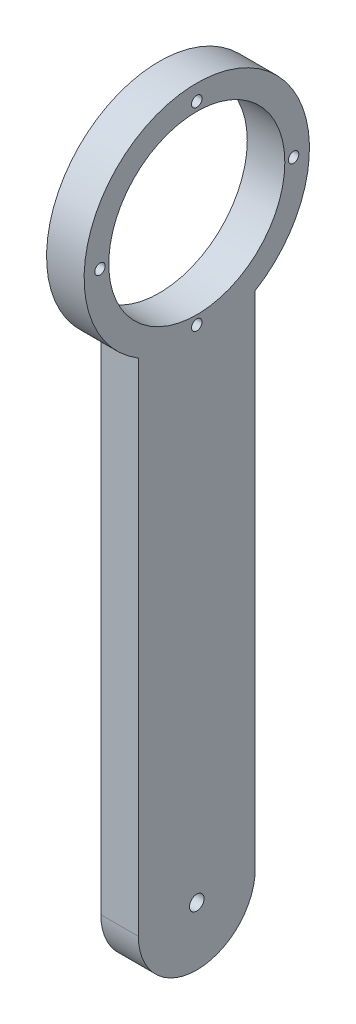
ISO-10303-21;
HEADER;
FILE_DESCRIPTION(('STEP AP214'),'2;1');
FILE_NAME('part.step','',(''),(''),'','','');
FILE_SCHEMA(('AUTOMOTIVE_DESIGN { 1 0 10303 214 1 1 1 1 }'));
ENDSEC;
DATA;
#1=APPLICATION_CONTEXT('core data for automotive mechanical design processes');
#2=APPLICATION_PROTOCOL_DEFINITION('international standard','automotive_design',2000,#1);
#3=PRODUCT_CONTEXT('',#1,'mechanical');
#4=PRODUCT('Part','Part','',(#3));
#5=PRODUCT_RELATED_PRODUCT_CATEGORY('part','',(#4));
#6=PRODUCT_DEFINITION_FORMATION('','',#4);
#7=PRODUCT_DEFINITION_CONTEXT('part definition',#1,'design');
#8=PRODUCT_DEFINITION('design','',#6,#7);
#9=PRODUCT_DEFINITION_SHAPE('','',#8);
#10=(LENGTH_UNIT() NAMED_UNIT(*) SI_UNIT(.MILLI.,.METRE.));
#11=(NAMED_UNIT(*) PLANE_ANGLE_UNIT() SI_UNIT($,.RADIAN.));
#12=(NAMED_UNIT(*) SI_UNIT($,.STERADIAN.) SOLID_ANGLE_UNIT());
#13=UNCERTAINTY_MEASURE_WITH_UNIT(LENGTH_MEASURE(1.E-05),#10,'distance_accuracy_value','');
#14=(GEOMETRIC_REPRESENTATION_CONTEXT(3) GLOBAL_UNCERTAINTY_ASSIGNED_CONTEXT((#13)) GLOBAL_UNIT_ASSIGNED_CONTEXT((#10,
#11,#12)) REPRESENTATION_CONTEXT('',''));
#15=CARTESIAN_POINT('',(0.,0.,0.));
#16=DIRECTION('',(0.,0.,1.));
#17=DIRECTION('',(1.,0.,0.));
#18=AXIS2_PLACEMENT_3D('',#15,#16,#17);
#19=CARTESIAN_POINT('',(9.,0.,-14.));
#20=DIRECTION('',(-1.,0.,0.));
#21=DIRECTION('',(0.,0.,1.));
#22=AXIS2_PLACEMENT_3D('',#19,#20,#21);
#23=CYLINDRICAL_SURFACE('',#22,14.);
#24=CARTESIAN_POINT('',(0.,0.,-14.));
#25=DIRECTION('',(1.,0.,0.));
#26=DIRECTION('',(0.,0.,-1.));
#27=AXIS2_PLACEMENT_3D('',#24,#25,#26);
#28=CIRCLE('',#27,14.);
#29=CARTESIAN_POINT('',(0.,0.,0.));
#30=VERTEX_POINT('',#29);
#31=CARTESIAN_POINT('',(0.,0.,-28.));
#32=VERTEX_POINT('',#31);
#33=EDGE_CURVE('E110',#30,#32,#28,.T.);
#34=ORIENTED_EDGE('',*,*,#33,.T.);
#35=DIRECTION('',(-1.,0.,0.));
#36=VECTOR('',#35,1.);
#37=CARTESIAN_POINT('',(9.,0.,-28.));
#38=LINE('',#37,#36);
#39=CARTESIAN_POINT('',(9.,0.,-28.));
#40=VERTEX_POINT('',#39);
#41=EDGE_CURVE('E11',#40,#32,#38,.T.);
#42=ORIENTED_EDGE('',*,*,#41,.F.);
#43=CARTESIAN_POINT('',(9.,0.,-14.));
#44=DIRECTION('',(1.,0.,0.));
#45=DIRECTION('',(0.,0.,-1.));
#46=AXIS2_PLACEMENT_3D('',#43,#44,#45);
#47=CIRCLE('',#46,14.);
#48=CARTESIAN_POINT('',(9.,0.,0.));
#49=VERTEX_POINT('',#48);
#50=EDGE_CURVE('E93',#49,#40,#47,.T.);
#51=ORIENTED_EDGE('',*,*,#50,.F.);
#52=DIRECTION('',(-1.,0.,0.));
#53=VECTOR('',#52,1.);
#54=CARTESIAN_POINT('',(9.,0.,0.));
#55=LINE('',#54,#53);
#56=EDGE_CURVE('E106',#49,#30,#55,.T.);
#57=ORIENTED_EDGE('',*,*,#56,.T.);
#58=EDGE_LOOP('',(#34,#42,#51,#57));
#59=FACE_BOUND('',#58,.T.);
#60=ADVANCED_FACE('F39',(#59),#23,.T.);
#61=CARTESIAN_POINT('',(9.,0.,-28.));
#62=DIRECTION('',(0.,0.,1.));
#63=DIRECTION('',(1.,0.,0.));
#64=AXIS2_PLACEMENT_3D('',#61,#62,#63);
#65=PLANE('',#64);
#66=DIRECTION('',(0.,1.,0.));
#67=VECTOR('',#66,1.);
#68=CARTESIAN_POINT('',(0.,0.,-28.));
#69=LINE('',#68,#67);
#70=CARTESIAN_POINT('',(0.,120.,-28.));
#71=VERTEX_POINT('',#70);
#72=EDGE_CURVE('E98',#32,#71,#69,.T.);
#73=ORIENTED_EDGE('',*,*,#72,.T.);
#74=DIRECTION('',(-1.,0.,0.));
#75=VECTOR('',#74,1.);
#76=CARTESIAN_POINT('',(9.,120.,-28.));
#77=LINE('',#76,#75);
#78=CARTESIAN_POINT('',(9.,120.,-28.));
#79=VERTEX_POINT('',#78);
#80=EDGE_CURVE('E49',#79,#71,#77,.T.);
#81=ORIENTED_EDGE('',*,*,#80,.F.);
#82=DIRECTION('',(0.,1.,0.));
#83=VECTOR('',#82,1.);
#84=CARTESIAN_POINT('',(9.,0.,-28.));
#85=LINE('',#84,#83);
#86=EDGE_CURVE('E88',#40,#79,#85,.T.);
#87=ORIENTED_EDGE('',*,*,#86,.F.);
#88=ORIENTED_EDGE('',*,*,#41,.T.);
#89=EDGE_LOOP('',(#73,#81,#87,#88));
#90=FACE_BOUND('',#89,.T.);
#91=ADVANCED_FACE('F97',(#90),#65,.F.);
#92=CARTESIAN_POINT('',(9.,143.08679276123,-14.));
#93=DIRECTION('',(-1.,0.,0.));
#94=DIRECTION('',(0.,0.,1.));
#95=AXIS2_PLACEMENT_3D('',#92,#93,#94);
#96=CYLINDRICAL_SURFACE('',#95,27.);
#97=CARTESIAN_POINT('',(0.,143.08679276123,-14.));
#98=DIRECTION('',(1.,0.,0.));
#99=DIRECTION('',(0.,0.,-1.));
#100=AXIS2_PLACEMENT_3D('',#97,#98,#99);
#101=CIRCLE('',#100,27.);
#102=CARTESIAN_POINT('',(0.,120.,0.));
#103=VERTEX_POINT('',#102);
#104=EDGE_CURVE('E75',#71,#103,#101,.T.);
#105=ORIENTED_EDGE('',*,*,#104,.T.);
#106=DIRECTION('',(-1.,0.,0.));
#107=VECTOR('',#106,1.);
#108=CARTESIAN_POINT('',(9.,120.,0.));
#109=LINE('',#108,#107);
#110=CARTESIAN_POINT('',(9.,120.,0.));
#111=VERTEX_POINT('',#110);
#112=EDGE_CURVE('E100',#111,#103,#109,.T.);
#113=ORIENTED_EDGE('',*,*,#112,.F.);
#114=CARTESIAN_POINT('',(9.,143.08679276123,-14.));
#115=DIRECTION('',(1.,0.,0.));
#116=DIRECTION('',(0.,0.,-1.));
#117=AXIS2_PLACEMENT_3D('',#114,#115,#116);
#118=CIRCLE('',#117,27.);
#119=EDGE_CURVE('E91',#79,#111,#118,.T.);
#120=ORIENTED_EDGE('',*,*,#119,.F.);
#121=ORIENTED_EDGE('',*,*,#80,.T.);
#122=EDGE_LOOP('',(#105,#113,#120,#121));
#123=FACE_BOUND('',#122,.T.);
#124=ADVANCED_FACE('F102',(#123),#96,.T.);
#125=CARTESIAN_POINT('',(9.,0.,0.));
#126=DIRECTION('',(0.,0.,-1.));
#127=DIRECTION('',(-1.,0.,0.));
#128=AXIS2_PLACEMENT_3D('',#125,#126,#127);
#129=PLANE('',#128);
#130=DIRECTION('',(0.,-1.,0.));
#131=VECTOR('',#130,1.);
#132=CARTESIAN_POINT('',(0.,0.,0.));
#133=LINE('',#132,#131);
#134=EDGE_CURVE('E81',#103,#30,#133,.T.);
#135=ORIENTED_EDGE('',*,*,#134,.T.);
#136=ORIENTED_EDGE('',*,*,#56,.F.);
#137=DIRECTION('',(0.,-1.,0.));
#138=VECTOR('',#137,1.);
#139=CARTESIAN_POINT('',(9.,0.,0.));
#140=LINE('',#139,#138);
#141=EDGE_CURVE('E58',#111,#49,#140,.T.);
#142=ORIENTED_EDGE('',*,*,#141,.F.);
#143=ORIENTED_EDGE('',*,*,#112,.T.);
#144=EDGE_LOOP('',(#135,#136,#142,#143));
#145=FACE_BOUND('',#144,.T.);
#146=ADVANCED_FACE('F192',(#145),#129,.F.);
#147=CARTESIAN_POINT('',(9.,0.,-14.));
#148=DIRECTION('',(1.,0.,0.));
#149=DIRECTION('',(0.,0.,-1.));
#150=AXIS2_PLACEMENT_3D('',#147,#148,#149);
#151=PLANE('',#150);
#152=CARTESIAN_POINT('',(9.,143.08679276123,9.2));
#153=DIRECTION('',(1.,0.,0.));
#154=DIRECTION('',(0.,0.,-1.));
#155=AXIS2_PLACEMENT_3D('',#152,#153,#154);
#156=CIRCLE('',#155,1.25);
#157=CARTESIAN_POINT('',(9.,143.08679276123,7.95));
#158=VERTEX_POINT('',#157);
#159=EDGE_CURVE('E142',#158,#158,#156,.T.);
#160=ORIENTED_EDGE('',*,*,#159,.F.);
#161=EDGE_LOOP('',(#160));
#162=FACE_BOUND('',#161,.T.);
#163=CARTESIAN_POINT('',(9.,119.88679276123,-14.));
#164=DIRECTION('',(1.,0.,0.));
#165=DIRECTION('',(0.,0.,-1.));
#166=AXIS2_PLACEMENT_3D('',#163,#164,#165);
#167=CIRCLE('',#166,1.25);
#168=CARTESIAN_POINT('',(9.,119.88679276123,-15.25));
#169=VERTEX_POINT('',#168);
#170=EDGE_CURVE('E146',#169,#169,#167,.T.);
#171=ORIENTED_EDGE('',*,*,#170,.F.);
#172=EDGE_LOOP('',(#171));
#173=FACE_BOUND('',#172,.T.);
#174=CARTESIAN_POINT('',(9.,143.08679276123,-37.2));
#175=DIRECTION('',(1.,0.,0.));
#176=DIRECTION('',(0.,0.,-1.));
#177=AXIS2_PLACEMENT_3D('',#174,#175,#176);
#178=CIRCLE('',#177,1.25);
#179=CARTESIAN_POINT('',(9.,143.08679276123,-38.45));
#180=VERTEX_POINT('',#179);
#181=EDGE_CURVE('E150',#180,#180,#178,.T.);
#182=ORIENTED_EDGE('',*,*,#181,.F.);
#183=EDGE_LOOP('',(#182));
#184=FACE_BOUND('',#183,.T.);
#185=CARTESIAN_POINT('',(9.,166.28679276123,-14.));
#186=DIRECTION('',(1.,0.,0.));
#187=DIRECTION('',(0.,0.,-1.));
#188=AXIS2_PLACEMENT_3D('',#185,#186,#187);
#189=CIRCLE('',#188,1.25);
#190=CARTESIAN_POINT('',(9.,166.28679276123,-15.25));
#191=VERTEX_POINT('',#190);
#192=EDGE_CURVE('E154',#191,#191,#189,.T.);
#193=ORIENTED_EDGE('',*,*,#192,.F.);
#194=EDGE_LOOP('',(#193));
#195=FACE_BOUND('',#194,.T.);
#196=CARTESIAN_POINT('',(9.,0.,-14.));
#197=DIRECTION('',(1.,0.,0.));
#198=DIRECTION('',(0.,0.,-1.));
#199=AXIS2_PLACEMENT_3D('',#196,#197,#198);
#200=CIRCLE('',#199,1.75);
#201=CARTESIAN_POINT('',(9.,0.,-15.75));
#202=VERTEX_POINT('',#201);
#203=EDGE_CURVE('E136',#202,#202,#200,.T.);
#204=ORIENTED_EDGE('',*,*,#203,.F.);
#205=EDGE_LOOP('',(#204));
#206=FACE_BOUND('',#205,.T.);
#207=CARTESIAN_POINT('',(9.,143.08679276123,-14.));
#208=DIRECTION('',(1.,0.,0.));
#209=DIRECTION('',(0.,0.,-1.));
#210=AXIS2_PLACEMENT_3D('',#207,#208,#209);
#211=CIRCLE('',#210,21.1);
#212=CARTESIAN_POINT('',(9.,143.08679276123,-35.1));
#213=VERTEX_POINT('',#212);
#214=EDGE_CURVE('E126',#213,#213,#211,.T.);
#215=ORIENTED_EDGE('',*,*,#214,.F.);
#216=EDGE_LOOP('',(#215));
#217=FACE_BOUND('',#216,.T.);
#218=ORIENTED_EDGE('',*,*,#50,.T.);
#219=ORIENTED_EDGE('',*,*,#86,.T.);
#220=ORIENTED_EDGE('',*,*,#119,.T.);
#221=ORIENTED_EDGE('',*,*,#141,.T.);
#222=EDGE_LOOP('',(#218,#219,#220,#221));
#223=FACE_BOUND('',#222,.T.);
#224=ADVANCED_FACE('F89',(#162,#173,#184,#195,#206,#217,#223),#151,.T.);
#225=CARTESIAN_POINT('',(0.,0.,-14.));
#226=DIRECTION('',(1.,0.,0.));
#227=DIRECTION('',(0.,0.,-1.));
#228=AXIS2_PLACEMENT_3D('',#225,#226,#227);
#229=PLANE('',#228);
#230=CARTESIAN_POINT('',(0.,143.08679276123,9.2));
#231=DIRECTION('',(-1.,0.,0.));
#232=DIRECTION('',(0.,0.,1.));
#233=AXIS2_PLACEMENT_3D('',#230,#231,#232);
#234=CIRCLE('',#233,1.25);
#235=CARTESIAN_POINT('',(0.,143.08679276123,10.45));
#236=VERTEX_POINT('',#235);
#237=EDGE_CURVE('E158',#236,#236,#234,.T.);
#238=ORIENTED_EDGE('',*,*,#237,.F.);
#239=EDGE_LOOP('',(#238));
#240=FACE_BOUND('',#239,.T.);
#241=CARTESIAN_POINT('',(0.,119.88679276123,-14.));
#242=DIRECTION('',(-1.,0.,0.));
#243=DIRECTION('',(0.,0.,1.));
#244=AXIS2_PLACEMENT_3D('',#241,#242,#243);
#245=CIRCLE('',#244,1.25);
#246=CARTESIAN_POINT('',(0.,119.88679276123,-12.75));
#247=VERTEX_POINT('',#246);
#248=EDGE_CURVE('E167',#247,#247,#245,.T.);
#249=ORIENTED_EDGE('',*,*,#248,.F.);
#250=EDGE_LOOP('',(#249));
#251=FACE_BOUND('',#250,.T.);
#252=CARTESIAN_POINT('',(0.,143.08679276123,-37.2));
#253=DIRECTION('',(-1.,0.,0.));
#254=DIRECTION('',(0.,0.,1.));
#255=AXIS2_PLACEMENT_3D('',#252,#253,#254);
#256=CIRCLE('',#255,1.25);
#257=CARTESIAN_POINT('',(0.,143.08679276123,-35.95));
#258=VERTEX_POINT('',#257);
#259=EDGE_CURVE('E163',#258,#258,#256,.T.);
#260=ORIENTED_EDGE('',*,*,#259,.F.);
#261=EDGE_LOOP('',(#260));
#262=FACE_BOUND('',#261,.T.);
#263=CARTESIAN_POINT('',(0.,166.28679276123,-14.));
#264=DIRECTION('',(-1.,0.,0.));
#265=DIRECTION('',(0.,0.,1.));
#266=AXIS2_PLACEMENT_3D('',#263,#264,#265);
#267=CIRCLE('',#266,1.25);
#268=CARTESIAN_POINT('',(0.,166.28679276123,-12.75));
#269=VERTEX_POINT('',#268);
#270=EDGE_CURVE('E159',#269,#269,#267,.T.);
#271=ORIENTED_EDGE('',*,*,#270,.F.);
#272=EDGE_LOOP('',(#271));
#273=FACE_BOUND('',#272,.T.);
#274=CARTESIAN_POINT('',(0.,0.,-14.));
#275=DIRECTION('',(1.,0.,0.));
#276=DIRECTION('',(0.,0.,-1.));
#277=AXIS2_PLACEMENT_3D('',#274,#275,#276);
#278=CIRCLE('',#277,1.75);
#279=CARTESIAN_POINT('',(0.,0.,-15.75));
#280=VERTEX_POINT('',#279);
#281=EDGE_CURVE('E42',#280,#280,#278,.T.);
#282=ORIENTED_EDGE('',*,*,#281,.T.);
#283=EDGE_LOOP('',(#282));
#284=FACE_BOUND('',#283,.T.);
#285=CARTESIAN_POINT('',(0.,143.08679276123,-14.));
#286=DIRECTION('',(1.,0.,0.));
#287=DIRECTION('',(0.,0.,-1.));
#288=AXIS2_PLACEMENT_3D('',#285,#286,#287);
#289=CIRCLE('',#288,21.1);
#290=CARTESIAN_POINT('',(0.,143.08679276123,-35.1));
#291=VERTEX_POINT('',#290);
#292=EDGE_CURVE('E114',#291,#291,#289,.T.);
#293=ORIENTED_EDGE('',*,*,#292,.T.);
#294=EDGE_LOOP('',(#293));
#295=FACE_BOUND('',#294,.T.);
#296=ORIENTED_EDGE('',*,*,#33,.F.);
#297=ORIENTED_EDGE('',*,*,#134,.F.);
#298=ORIENTED_EDGE('',*,*,#104,.F.);
#299=ORIENTED_EDGE('',*,*,#72,.F.);
#300=EDGE_LOOP('',(#296,#297,#298,#299));
#301=FACE_BOUND('',#300,.T.);
#302=ADVANCED_FACE('F177',(#240,#251,#262,#273,#284,#295,#301),#229,.F.);
#303=CARTESIAN_POINT('',(-1.,143.08679276123,-14.));
#304=DIRECTION('',(1.,0.,0.));
#305=DIRECTION('',(0.,0.,-1.));
#306=AXIS2_PLACEMENT_3D('',#303,#304,#305);
#307=CYLINDRICAL_SURFACE('',#306,21.1);
#308=ORIENTED_EDGE('',*,*,#214,.T.);
#309=EDGE_LOOP('',(#308));
#310=FACE_BOUND('',#309,.T.);
#311=ORIENTED_EDGE('',*,*,#292,.F.);
#312=EDGE_LOOP('',(#311));
#313=FACE_BOUND('',#312,.T.);
#314=ADVANCED_FACE('F180',(#310,#313),#307,.F.);
#315=CARTESIAN_POINT('',(-1.,0.,-14.));
#316=DIRECTION('',(1.,0.,0.));
#317=DIRECTION('',(0.,0.,-1.));
#318=AXIS2_PLACEMENT_3D('',#315,#316,#317);
#319=CYLINDRICAL_SURFACE('',#318,1.75);
#320=ORIENTED_EDGE('',*,*,#203,.T.);
#321=EDGE_LOOP('',(#320));
#322=FACE_BOUND('',#321,.T.);
#323=ORIENTED_EDGE('',*,*,#281,.F.);
#324=EDGE_LOOP('',(#323));
#325=FACE_BOUND('',#324,.T.);
#326=ADVANCED_FACE('F226',(#322,#325),#319,.F.);
#327=CARTESIAN_POINT('',(10.,166.28679276123,-14.));
#328=DIRECTION('',(-1.,0.,0.));
#329=DIRECTION('',(0.,0.,1.));
#330=AXIS2_PLACEMENT_3D('',#327,#328,#329);
#331=CYLINDRICAL_SURFACE('',#330,1.25);
#332=ORIENTED_EDGE('',*,*,#192,.T.);
#333=EDGE_LOOP('',(#332));
#334=FACE_BOUND('',#333,.T.);
#335=ORIENTED_EDGE('',*,*,#270,.T.);
#336=EDGE_LOOP('',(#335));
#337=FACE_BOUND('',#336,.T.);
#338=ADVANCED_FACE('F236',(#334,#337),#331,.F.);
#339=CARTESIAN_POINT('',(10.,143.08679276123,-37.2));
#340=DIRECTION('',(-1.,0.,0.));
#341=DIRECTION('',(0.,0.,1.));
#342=AXIS2_PLACEMENT_3D('',#339,#340,#341);
#343=CYLINDRICAL_SURFACE('',#342,1.25);
#344=ORIENTED_EDGE('',*,*,#181,.T.);
#345=EDGE_LOOP('',(#344));
#346=FACE_BOUND('',#345,.T.);
#347=ORIENTED_EDGE('',*,*,#259,.T.);
#348=EDGE_LOOP('',(#347));
#349=FACE_BOUND('',#348,.T.);
#350=ADVANCED_FACE('F258',(#346,#349),#343,.F.);
#351=CARTESIAN_POINT('',(10.,119.88679276123,-14.));
#352=DIRECTION('',(-1.,0.,0.));
#353=DIRECTION('',(0.,0.,1.));
#354=AXIS2_PLACEMENT_3D('',#351,#352,#353);
#355=CYLINDRICAL_SURFACE('',#354,1.25);
#356=ORIENTED_EDGE('',*,*,#170,.T.);
#357=EDGE_LOOP('',(#356));
#358=FACE_BOUND('',#357,.T.);
#359=ORIENTED_EDGE('',*,*,#248,.T.);
#360=EDGE_LOOP('',(#359));
#361=FACE_BOUND('',#360,.T.);
#362=ADVANCED_FACE('F268',(#358,#361),#355,.F.);
#363=CARTESIAN_POINT('',(10.,143.08679276123,9.2));
#364=DIRECTION('',(-1.,0.,0.));
#365=DIRECTION('',(0.,0.,1.));
#366=AXIS2_PLACEMENT_3D('',#363,#364,#365);
#367=CYLINDRICAL_SURFACE('',#366,1.25);
#368=ORIENTED_EDGE('',*,*,#159,.T.);
#369=EDGE_LOOP('',(#368));
#370=FACE_BOUND('',#369,.T.);
#371=ORIENTED_EDGE('',*,*,#237,.T.);
#372=EDGE_LOOP('',(#371));
#373=FACE_BOUND('',#372,.T.);
#374=ADVANCED_FACE('F175',(#370,#373),#367,.F.);
#375=CLOSED_SHELL('',(#60,#91,#124,#146,#224,#302,#314,#326,#338,#350,#362,#374));
#376=MANIFOLD_SOLID_BREP('B2',#375);
#377=ADVANCED_BREP_SHAPE_REPRESENTATION('',(#18,#376),#14);
#378=SHAPE_DEFINITION_REPRESENTATION(#9,#377);
ENDSEC;
END-ISO-10303-21;
